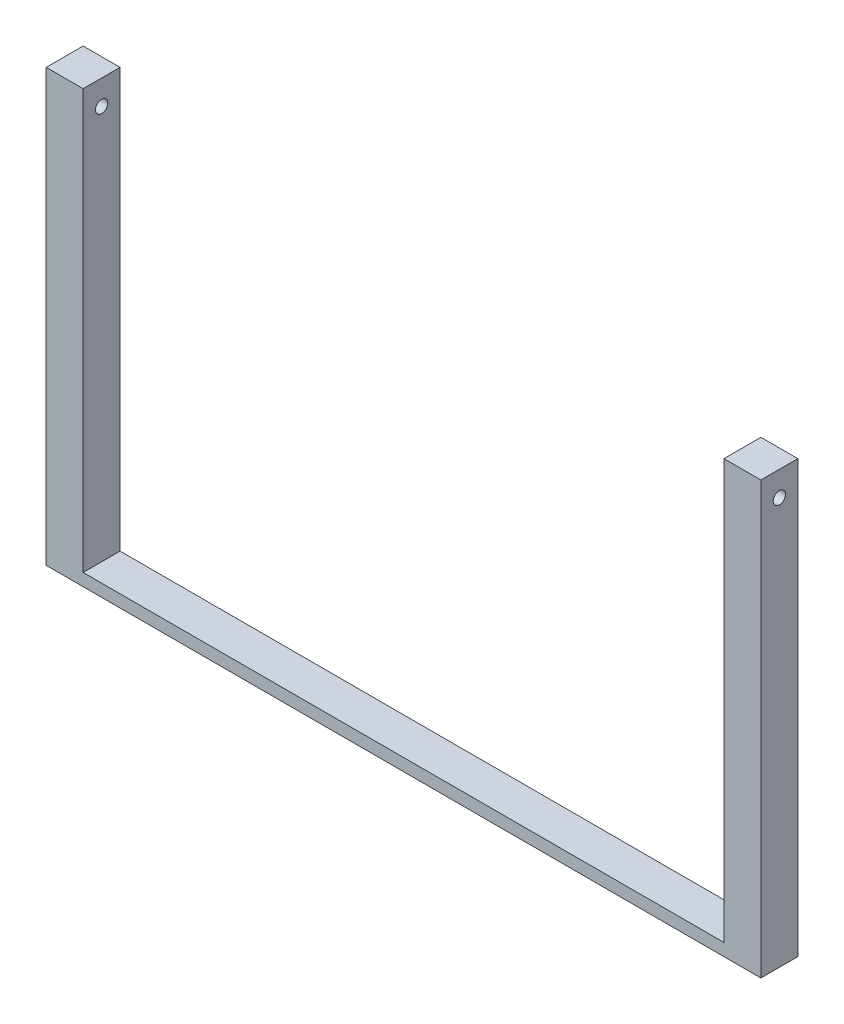
ISO-10303-21;
HEADER;
FILE_DESCRIPTION(('STEP AP214'),'2;1');
FILE_NAME('part.step','',(''),(''),'','','');
FILE_SCHEMA(('AUTOMOTIVE_DESIGN { 1 0 10303 214 1 1 1 1 }'));
ENDSEC;
DATA;
#1=APPLICATION_CONTEXT('core data for automotive mechanical design processes');
#2=APPLICATION_PROTOCOL_DEFINITION('international standard','automotive_design',2000,#1);
#3=PRODUCT_CONTEXT('',#1,'mechanical');
#4=PRODUCT('Part','Part','',(#3));
#5=PRODUCT_RELATED_PRODUCT_CATEGORY('part','',(#4));
#6=PRODUCT_DEFINITION_FORMATION('','',#4);
#7=PRODUCT_DEFINITION_CONTEXT('part definition',#1,'design');
#8=PRODUCT_DEFINITION('design','',#6,#7);
#9=PRODUCT_DEFINITION_SHAPE('','',#8);
#10=(LENGTH_UNIT() NAMED_UNIT(*) SI_UNIT(.MILLI.,.METRE.));
#11=(NAMED_UNIT(*) PLANE_ANGLE_UNIT() SI_UNIT($,.RADIAN.));
#12=(NAMED_UNIT(*) SI_UNIT($,.STERADIAN.) SOLID_ANGLE_UNIT());
#13=UNCERTAINTY_MEASURE_WITH_UNIT(LENGTH_MEASURE(1.E-05),#10,'distance_accuracy_value','');
#14=(GEOMETRIC_REPRESENTATION_CONTEXT(3) GLOBAL_UNCERTAINTY_ASSIGNED_CONTEXT((#13)) GLOBAL_UNIT_ASSIGNED_CONTEXT((#10,
#11,#12)) REPRESENTATION_CONTEXT('',''));
#15=CARTESIAN_POINT('',(0.,0.,0.));
#16=DIRECTION('',(0.,0.,1.));
#17=DIRECTION('',(1.,0.,0.));
#18=AXIS2_PLACEMENT_3D('',#15,#16,#17);
#19=CARTESIAN_POINT('',(0.,12.7,0.));
#20=DIRECTION('',(0.,1.,0.));
#21=DIRECTION('',(0.,0.,1.));
#22=AXIS2_PLACEMENT_3D('',#19,#20,#21);
#23=PLANE('',#22);
#24=DIRECTION('',(1.,0.,0.));
#25=VECTOR('',#24,1.);
#26=CARTESIAN_POINT('',(-368.3,12.7,19.05));
#27=LINE('',#26,#25);
#28=CARTESIAN_POINT('',(-330.2,12.7,19.05));
#29=VERTEX_POINT('',#28);
#30=CARTESIAN_POINT('',(330.2,12.7,19.05));
#31=VERTEX_POINT('',#30);
#32=EDGE_CURVE('E57',#29,#31,#27,.T.);
#33=ORIENTED_EDGE('',*,*,#32,.T.);
#34=DIRECTION('',(0.,0.,1.));
#35=VECTOR('',#34,1.);
#36=CARTESIAN_POINT('',(330.2,12.7,19.05));
#37=LINE('',#36,#35);
#38=CARTESIAN_POINT('',(330.2,12.7,-19.05));
#39=VERTEX_POINT('',#38);
#40=EDGE_CURVE('E52',#39,#31,#37,.T.);
#41=ORIENTED_EDGE('',*,*,#40,.F.);
#42=DIRECTION('',(-1.,0.,0.));
#43=VECTOR('',#42,1.);
#44=CARTESIAN_POINT('',(-368.3,12.7,-19.05));
#45=LINE('',#44,#43);
#46=CARTESIAN_POINT('',(-330.2,12.7,-19.05));
#47=VERTEX_POINT('',#46);
#48=EDGE_CURVE('E151',#39,#47,#45,.T.);
#49=ORIENTED_EDGE('',*,*,#48,.T.);
#50=DIRECTION('',(0.,0.,-1.));
#51=VECTOR('',#50,1.);
#52=CARTESIAN_POINT('',(-330.2,12.7,19.05));
#53=LINE('',#52,#51);
#54=EDGE_CURVE('E132',#29,#47,#53,.T.);
#55=ORIENTED_EDGE('',*,*,#54,.F.);
#56=EDGE_LOOP('',(#33,#41,#49,#55));
#57=FACE_BOUND('',#56,.T.);
#58=ADVANCED_FACE('F36',(#57),#23,.T.);
#59=CARTESIAN_POINT('',(368.3,12.7,-19.05));
#60=DIRECTION('',(-1.,0.,0.));
#61=DIRECTION('',(0.,0.,1.));
#62=AXIS2_PLACEMENT_3D('',#59,#60,#61);
#63=PLANE('',#62);
#64=CARTESIAN_POINT('',(368.3,419.1,0.));
#65=DIRECTION('',(1.,0.,0.));
#66=DIRECTION('',(0.,0.,-1.));
#67=AXIS2_PLACEMENT_3D('',#64,#65,#66);
#68=CIRCLE('',#67,6.35);
#69=CARTESIAN_POINT('',(368.3,419.1,-6.35));
#70=VERTEX_POINT('',#69);
#71=EDGE_CURVE('E314',#70,#70,#68,.T.);
#72=ORIENTED_EDGE('',*,*,#71,.F.);
#73=EDGE_LOOP('',(#72));
#74=FACE_BOUND('',#73,.T.);
#75=DIRECTION('',(0.,0.,-1.));
#76=VECTOR('',#75,1.);
#77=CARTESIAN_POINT('',(368.3,0.,-19.05));
#78=LINE('',#77,#76);
#79=CARTESIAN_POINT('',(368.3,0.,19.05));
#80=VERTEX_POINT('',#79);
#81=CARTESIAN_POINT('',(368.3,0.,-19.05));
#82=VERTEX_POINT('',#81);
#83=EDGE_CURVE('E105',#80,#82,#78,.T.);
#84=ORIENTED_EDGE('',*,*,#83,.T.);
#85=DIRECTION('',(0.,-1.,0.));
#86=VECTOR('',#85,1.);
#87=CARTESIAN_POINT('',(368.3,12.7,-19.05));
#88=LINE('',#87,#86);
#89=CARTESIAN_POINT('',(368.3,444.5,-19.05));
#90=VERTEX_POINT('',#89);
#91=EDGE_CURVE('E11',#90,#82,#88,.T.);
#92=ORIENTED_EDGE('',*,*,#91,.F.);
#93=DIRECTION('',(0.,0.,-1.));
#94=VECTOR('',#93,1.);
#95=CARTESIAN_POINT('',(368.3,444.5,19.05));
#96=LINE('',#95,#94);
#97=CARTESIAN_POINT('',(368.3,444.5,19.05));
#98=VERTEX_POINT('',#97);
#99=EDGE_CURVE('E103',#98,#90,#96,.T.);
#100=ORIENTED_EDGE('',*,*,#99,.F.);
#101=DIRECTION('',(0.,-1.,0.));
#102=VECTOR('',#101,1.);
#103=CARTESIAN_POINT('',(368.3,12.7,19.05));
#104=LINE('',#103,#102);
#105=EDGE_CURVE('E155',#98,#80,#104,.T.);
#106=ORIENTED_EDGE('',*,*,#105,.T.);
#107=EDGE_LOOP('',(#84,#92,#100,#106));
#108=FACE_BOUND('',#107,.T.);
#109=ADVANCED_FACE('F38',(#74,#108),#63,.F.);
#110=CARTESIAN_POINT('',(-368.3,12.7,-19.05));
#111=DIRECTION('',(0.,0.,1.));
#112=DIRECTION('',(1.,0.,0.));
#113=AXIS2_PLACEMENT_3D('',#110,#111,#112);
#114=PLANE('',#113);
#115=DIRECTION('',(-1.,0.,0.));
#116=VECTOR('',#115,1.);
#117=CARTESIAN_POINT('',(-368.3,0.,-19.05));
#118=LINE('',#117,#116);
#119=CARTESIAN_POINT('',(-368.3,0.,-19.05));
#120=VERTEX_POINT('',#119);
#121=EDGE_CURVE('E157',#82,#120,#118,.T.);
#122=ORIENTED_EDGE('',*,*,#121,.T.);
#123=DIRECTION('',(0.,-1.,0.));
#124=VECTOR('',#123,1.);
#125=CARTESIAN_POINT('',(-368.3,12.7,-19.05));
#126=LINE('',#125,#124);
#127=CARTESIAN_POINT('',(-368.3,444.5,-19.05));
#128=VERTEX_POINT('',#127);
#129=EDGE_CURVE('E45',#128,#120,#126,.T.);
#130=ORIENTED_EDGE('',*,*,#129,.F.);
#131=DIRECTION('',(-1.,0.,0.));
#132=VECTOR('',#131,1.);
#133=CARTESIAN_POINT('',(-330.2,444.5,-19.05));
#134=LINE('',#133,#132);
#135=CARTESIAN_POINT('',(-330.2,444.5,-19.05));
#136=VERTEX_POINT('',#135);
#137=EDGE_CURVE('E140',#136,#128,#134,.T.);
#138=ORIENTED_EDGE('',*,*,#137,.F.);
#139=DIRECTION('',(0.,-1.,0.));
#140=VECTOR('',#139,1.);
#141=CARTESIAN_POINT('',(-330.2,444.5,-19.05));
#142=LINE('',#141,#140);
#143=EDGE_CURVE('E143',#136,#47,#142,.T.);
#144=ORIENTED_EDGE('',*,*,#143,.T.);
#145=ORIENTED_EDGE('',*,*,#48,.F.);
#146=DIRECTION('',(0.,-1.,0.));
#147=VECTOR('',#146,1.);
#148=CARTESIAN_POINT('',(330.2,444.5,-19.05));
#149=LINE('',#148,#147);
#150=CARTESIAN_POINT('',(330.2,444.5,-19.05));
#151=VERTEX_POINT('',#150);
#152=EDGE_CURVE('E111',#151,#39,#149,.T.);
#153=ORIENTED_EDGE('',*,*,#152,.F.);
#154=DIRECTION('',(-1.,0.,0.));
#155=VECTOR('',#154,1.);
#156=CARTESIAN_POINT('',(330.2,444.5,-19.05));
#157=LINE('',#156,#155);
#158=EDGE_CURVE('E108',#90,#151,#157,.T.);
#159=ORIENTED_EDGE('',*,*,#158,.F.);
#160=ORIENTED_EDGE('',*,*,#91,.T.);
#161=EDGE_LOOP('',(#122,#130,#138,#144,#145,#153,#159,#160));
#162=FACE_BOUND('',#161,.T.);
#163=ADVANCED_FACE('F109',(#162),#114,.F.);
#164=CARTESIAN_POINT('',(-368.3,12.7,-19.05));
#165=DIRECTION('',(1.,0.,0.));
#166=DIRECTION('',(0.,0.,-1.));
#167=AXIS2_PLACEMENT_3D('',#164,#165,#166);
#168=PLANE('',#167);
#169=CARTESIAN_POINT('',(-368.3,419.1,0.));
#170=DIRECTION('',(1.,0.,0.));
#171=DIRECTION('',(0.,0.,-1.));
#172=AXIS2_PLACEMENT_3D('',#169,#170,#171);
#173=CIRCLE('',#172,6.35);
#174=CARTESIAN_POINT('',(-368.3,419.1,-6.35));
#175=VERTEX_POINT('',#174);
#176=EDGE_CURVE('E310',#175,#175,#173,.T.);
#177=ORIENTED_EDGE('',*,*,#176,.T.);
#178=EDGE_LOOP('',(#177));
#179=FACE_BOUND('',#178,.T.);
#180=DIRECTION('',(0.,0.,1.));
#181=VECTOR('',#180,1.);
#182=CARTESIAN_POINT('',(-368.3,0.,-19.05));
#183=LINE('',#182,#181);
#184=CARTESIAN_POINT('',(-368.3,0.,19.05));
#185=VERTEX_POINT('',#184);
#186=EDGE_CURVE('E159',#120,#185,#183,.T.);
#187=ORIENTED_EDGE('',*,*,#186,.T.);
#188=DIRECTION('',(0.,-1.,0.));
#189=VECTOR('',#188,1.);
#190=CARTESIAN_POINT('',(-368.3,12.7,19.05));
#191=LINE('',#190,#189);
#192=CARTESIAN_POINT('',(-368.3,444.5,19.05));
#193=VERTEX_POINT('',#192);
#194=EDGE_CURVE('E163',#193,#185,#191,.T.);
#195=ORIENTED_EDGE('',*,*,#194,.F.);
#196=DIRECTION('',(0.,0.,1.));
#197=VECTOR('',#196,1.);
#198=CARTESIAN_POINT('',(-368.3,444.5,19.05));
#199=LINE('',#198,#197);
#200=EDGE_CURVE('E133',#128,#193,#199,.T.);
#201=ORIENTED_EDGE('',*,*,#200,.F.);
#202=ORIENTED_EDGE('',*,*,#129,.T.);
#203=EDGE_LOOP('',(#187,#195,#201,#202));
#204=FACE_BOUND('',#203,.T.);
#205=ADVANCED_FACE('F170',(#179,#204),#168,.F.);
#206=CARTESIAN_POINT('',(-368.3,12.7,19.05));
#207=DIRECTION('',(0.,0.,-1.));
#208=DIRECTION('',(-1.,0.,0.));
#209=AXIS2_PLACEMENT_3D('',#206,#207,#208);
#210=PLANE('',#209);
#211=DIRECTION('',(1.,0.,0.));
#212=VECTOR('',#211,1.);
#213=CARTESIAN_POINT('',(-368.3,0.,19.05));
#214=LINE('',#213,#212);
#215=EDGE_CURVE('E153',#185,#80,#214,.T.);
#216=ORIENTED_EDGE('',*,*,#215,.T.);
#217=ORIENTED_EDGE('',*,*,#105,.F.);
#218=DIRECTION('',(1.,0.,0.));
#219=VECTOR('',#218,1.);
#220=CARTESIAN_POINT('',(330.2,444.5,19.05));
#221=LINE('',#220,#219);
#222=CARTESIAN_POINT('',(330.2,444.5,19.05));
#223=VERTEX_POINT('',#222);
#224=EDGE_CURVE('E119',#223,#98,#221,.T.);
#225=ORIENTED_EDGE('',*,*,#224,.F.);
#226=DIRECTION('',(0.,-1.,0.));
#227=VECTOR('',#226,1.);
#228=CARTESIAN_POINT('',(330.2,444.5,19.05));
#229=LINE('',#228,#227);
#230=EDGE_CURVE('E127',#223,#31,#229,.T.);
#231=ORIENTED_EDGE('',*,*,#230,.T.);
#232=ORIENTED_EDGE('',*,*,#32,.F.);
#233=DIRECTION('',(0.,-1.,0.));
#234=VECTOR('',#233,1.);
#235=CARTESIAN_POINT('',(-330.2,444.5,19.05));
#236=LINE('',#235,#234);
#237=CARTESIAN_POINT('',(-330.2,444.5,19.05));
#238=VERTEX_POINT('',#237);
#239=EDGE_CURVE('E148',#238,#29,#236,.T.);
#240=ORIENTED_EDGE('',*,*,#239,.F.);
#241=DIRECTION('',(1.,0.,0.));
#242=VECTOR('',#241,1.);
#243=CARTESIAN_POINT('',(-330.2,444.5,19.05));
#244=LINE('',#243,#242);
#245=EDGE_CURVE('E136',#193,#238,#244,.T.);
#246=ORIENTED_EDGE('',*,*,#245,.F.);
#247=ORIENTED_EDGE('',*,*,#194,.T.);
#248=EDGE_LOOP('',(#216,#217,#225,#231,#232,#240,#246,#247));
#249=FACE_BOUND('',#248,.T.);
#250=ADVANCED_FACE('F176',(#249),#210,.F.);
#251=CARTESIAN_POINT('',(0.,0.,0.));
#252=DIRECTION('',(0.,1.,0.));
#253=DIRECTION('',(0.,0.,1.));
#254=AXIS2_PLACEMENT_3D('',#251,#252,#253);
#255=PLANE('',#254);
#256=ORIENTED_EDGE('',*,*,#83,.F.);
#257=ORIENTED_EDGE('',*,*,#215,.F.);
#258=ORIENTED_EDGE('',*,*,#186,.F.);
#259=ORIENTED_EDGE('',*,*,#121,.F.);
#260=EDGE_LOOP('',(#256,#257,#258,#259));
#261=FACE_BOUND('',#260,.T.);
#262=ADVANCED_FACE('F174',(#261),#255,.F.);
#263=CARTESIAN_POINT('',(-330.2,444.5,19.05));
#264=DIRECTION('',(-1.,0.,0.));
#265=DIRECTION('',(0.,0.,1.));
#266=AXIS2_PLACEMENT_3D('',#263,#264,#265);
#267=PLANE('',#266);
#268=CARTESIAN_POINT('',(-330.2,419.1,0.));
#269=DIRECTION('',(-1.,0.,0.));
#270=DIRECTION('',(0.,0.,1.));
#271=AXIS2_PLACEMENT_3D('',#268,#269,#270);
#272=CIRCLE('',#271,6.35);
#273=CARTESIAN_POINT('',(-330.2,419.1,6.35));
#274=VERTEX_POINT('',#273);
#275=EDGE_CURVE('E121',#274,#274,#272,.T.);
#276=ORIENTED_EDGE('',*,*,#275,.T.);
#277=EDGE_LOOP('',(#276));
#278=FACE_BOUND('',#277,.T.);
#279=ORIENTED_EDGE('',*,*,#54,.T.);
#280=ORIENTED_EDGE('',*,*,#143,.F.);
#281=DIRECTION('',(0.,0.,-1.));
#282=VECTOR('',#281,1.);
#283=CARTESIAN_POINT('',(-330.2,444.5,19.05));
#284=LINE('',#283,#282);
#285=EDGE_CURVE('E138',#238,#136,#284,.T.);
#286=ORIENTED_EDGE('',*,*,#285,.F.);
#287=ORIENTED_EDGE('',*,*,#239,.T.);
#288=EDGE_LOOP('',(#279,#280,#286,#287));
#289=FACE_BOUND('',#288,.T.);
#290=ADVANCED_FACE('F184',(#278,#289),#267,.F.);
#291=CARTESIAN_POINT('',(0.,444.5,0.));
#292=DIRECTION('',(0.,1.,0.));
#293=DIRECTION('',(0.,0.,1.));
#294=AXIS2_PLACEMENT_3D('',#291,#292,#293);
#295=PLANE('',#294);
#296=ORIENTED_EDGE('',*,*,#200,.T.);
#297=ORIENTED_EDGE('',*,*,#245,.T.);
#298=ORIENTED_EDGE('',*,*,#285,.T.);
#299=ORIENTED_EDGE('',*,*,#137,.T.);
#300=EDGE_LOOP('',(#296,#297,#298,#299));
#301=FACE_BOUND('',#300,.T.);
#302=ADVANCED_FACE('F181',(#301),#295,.T.);
#303=CARTESIAN_POINT('',(330.2,444.5,19.05));
#304=DIRECTION('',(1.,0.,0.));
#305=DIRECTION('',(0.,0.,-1.));
#306=AXIS2_PLACEMENT_3D('',#303,#304,#305);
#307=PLANE('',#306);
#308=CARTESIAN_POINT('',(330.2,419.1,0.));
#309=DIRECTION('',(1.,0.,0.));
#310=DIRECTION('',(0.,0.,-1.));
#311=AXIS2_PLACEMENT_3D('',#308,#309,#310);
#312=CIRCLE('',#311,6.35);
#313=CARTESIAN_POINT('',(330.2,419.1,-6.35));
#314=VERTEX_POINT('',#313);
#315=EDGE_CURVE('E40',#314,#314,#312,.T.);
#316=ORIENTED_EDGE('',*,*,#315,.T.);
#317=EDGE_LOOP('',(#316));
#318=FACE_BOUND('',#317,.T.);
#319=ORIENTED_EDGE('',*,*,#40,.T.);
#320=ORIENTED_EDGE('',*,*,#230,.F.);
#321=DIRECTION('',(0.,0.,1.));
#322=VECTOR('',#321,1.);
#323=CARTESIAN_POINT('',(330.2,444.5,19.05));
#324=LINE('',#323,#322);
#325=EDGE_CURVE('E114',#151,#223,#324,.T.);
#326=ORIENTED_EDGE('',*,*,#325,.F.);
#327=ORIENTED_EDGE('',*,*,#152,.T.);
#328=EDGE_LOOP('',(#319,#320,#326,#327));
#329=FACE_BOUND('',#328,.T.);
#330=ADVANCED_FACE('F187',(#318,#329),#307,.F.);
#331=CARTESIAN_POINT('',(0.,444.5,0.));
#332=DIRECTION('',(0.,-1.,0.));
#333=DIRECTION('',(0.,0.,-1.));
#334=AXIS2_PLACEMENT_3D('',#331,#332,#333);
#335=PLANE('',#334);
#336=ORIENTED_EDGE('',*,*,#99,.T.);
#337=ORIENTED_EDGE('',*,*,#158,.T.);
#338=ORIENTED_EDGE('',*,*,#325,.T.);
#339=ORIENTED_EDGE('',*,*,#224,.T.);
#340=EDGE_LOOP('',(#336,#337,#338,#339));
#341=FACE_BOUND('',#340,.T.);
#342=ADVANCED_FACE('F117',(#341),#335,.F.);
#343=CARTESIAN_POINT('',(-368.3,419.1,0.));
#344=DIRECTION('',(1.,0.,0.));
#345=DIRECTION('',(0.,0.,-1.));
#346=AXIS2_PLACEMENT_3D('',#343,#344,#345);
#347=CYLINDRICAL_SURFACE('',#346,6.35);
#348=ORIENTED_EDGE('',*,*,#71,.T.);
#349=EDGE_LOOP('',(#348));
#350=FACE_BOUND('',#349,.T.);
#351=ORIENTED_EDGE('',*,*,#315,.F.);
#352=EDGE_LOOP('',(#351));
#353=FACE_BOUND('',#352,.T.);
#354=ADVANCED_FACE('F195',(#350,#353),#347,.F.);
#355=ORIENTED_EDGE('',*,*,#176,.F.);
#356=EDGE_LOOP('',(#355));
#357=FACE_BOUND('',#356,.T.);
#358=ORIENTED_EDGE('',*,*,#275,.F.);
#359=EDGE_LOOP('',(#358));
#360=FACE_BOUND('',#359,.T.);
#361=ADVANCED_FACE('F294',(#357,#360),#347,.F.);
#362=CLOSED_SHELL('',(#58,#109,#163,#205,#250,#262,#290,#302,#330,#342,#354,#361));
#363=MANIFOLD_SOLID_BREP('B2',#362);
#364=ADVANCED_BREP_SHAPE_REPRESENTATION('',(#18,#363),#14);
#365=SHAPE_DEFINITION_REPRESENTATION(#9,#364);
ENDSEC;
END-ISO-10303-21;
